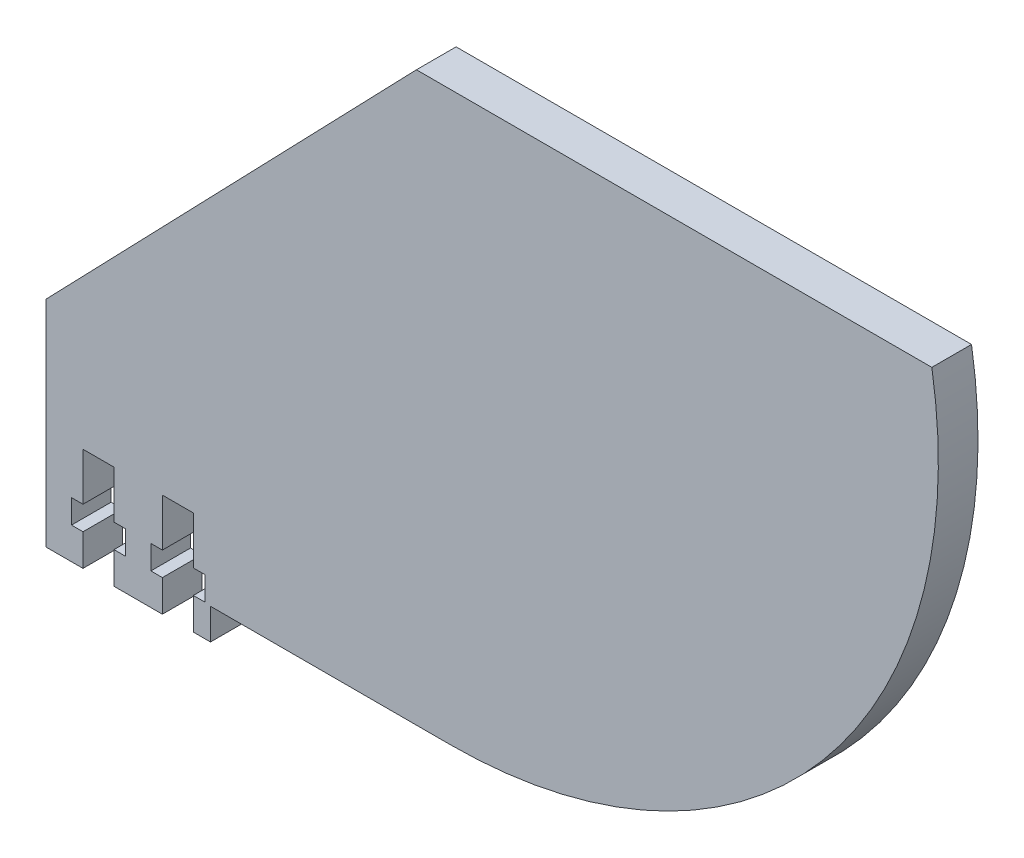
ISO-10303-21;
HEADER;
FILE_DESCRIPTION(('STEP AP214'),'2;1');
FILE_NAME('part.step','',(''),(''),'','','');
FILE_SCHEMA(('AUTOMOTIVE_DESIGN { 1 0 10303 214 1 1 1 1 }'));
ENDSEC;
DATA;
#1=APPLICATION_CONTEXT('core data for automotive mechanical design processes');
#2=APPLICATION_PROTOCOL_DEFINITION('international standard','automotive_design',2000,#1);
#3=PRODUCT_CONTEXT('',#1,'mechanical');
#4=PRODUCT('Part','Part','',(#3));
#5=PRODUCT_RELATED_PRODUCT_CATEGORY('part','',(#4));
#6=PRODUCT_DEFINITION_FORMATION('','',#4);
#7=PRODUCT_DEFINITION_CONTEXT('part definition',#1,'design');
#8=PRODUCT_DEFINITION('design','',#6,#7);
#9=PRODUCT_DEFINITION_SHAPE('','',#8);
#10=(LENGTH_UNIT() NAMED_UNIT(*) SI_UNIT(.MILLI.,.METRE.));
#11=(NAMED_UNIT(*) PLANE_ANGLE_UNIT() SI_UNIT($,.RADIAN.));
#12=(NAMED_UNIT(*) SI_UNIT($,.STERADIAN.) SOLID_ANGLE_UNIT());
#13=UNCERTAINTY_MEASURE_WITH_UNIT(LENGTH_MEASURE(1.E-05),#10,'distance_accuracy_value','');
#14=(GEOMETRIC_REPRESENTATION_CONTEXT(3) GLOBAL_UNCERTAINTY_ASSIGNED_CONTEXT((#13)) GLOBAL_UNIT_ASSIGNED_CONTEXT((#10,
#11,#12)) REPRESENTATION_CONTEXT('',''));
#15=CARTESIAN_POINT('',(0.,0.,0.));
#16=DIRECTION('',(0.,0.,1.));
#17=DIRECTION('',(1.,0.,0.));
#18=AXIS2_PLACEMENT_3D('',#15,#16,#17);
#19=CARTESIAN_POINT('',(-252.870000000149,-75.3999999999971,5.));
#20=DIRECTION('',(0.,1.,0.));
#21=DIRECTION('',(0.,0.,1.));
#22=AXIS2_PLACEMENT_3D('',#19,#20,#21);
#23=PLANE('',#22);
#24=DIRECTION('',(1.,0.,0.));
#25=VECTOR('',#24,1.);
#26=CARTESIAN_POINT('',(-252.870000000149,-75.3999999999971,0.));
#27=LINE('',#26,#25);
#28=CARTESIAN_POINT('',(-252.870000000149,-75.3999999999971,0.));
#29=VERTEX_POINT('',#28);
#30=CARTESIAN_POINT('',(-248.210000000147,-75.3999999999971,0.));
#31=VERTEX_POINT('',#30);
#32=EDGE_CURVE('E254',#29,#31,#27,.T.);
#33=ORIENTED_EDGE('',*,*,#32,.T.);
#34=DIRECTION('',(0.,0.,1.));
#35=VECTOR('',#34,1.);
#36=CARTESIAN_POINT('',(-248.210000000147,-75.3999999999971,0.));
#37=LINE('',#36,#35);
#38=CARTESIAN_POINT('',(-248.210000000147,-75.3999999999971,5.));
#39=VERTEX_POINT('',#38);
#40=EDGE_CURVE('E238',#31,#39,#37,.T.);
#41=ORIENTED_EDGE('',*,*,#40,.T.);
#42=DIRECTION('',(1.,0.,0.));
#43=VECTOR('',#42,1.);
#44=CARTESIAN_POINT('',(-252.870000000149,-75.3999999999971,5.));
#45=LINE('',#44,#43);
#46=CARTESIAN_POINT('',(-252.870000000149,-75.3999999999971,5.));
#47=VERTEX_POINT('',#46);
#48=EDGE_CURVE('E293',#47,#39,#45,.T.);
#49=ORIENTED_EDGE('',*,*,#48,.F.);
#50=DIRECTION('',(0.,0.,-1.));
#51=VECTOR('',#50,1.);
#52=CARTESIAN_POINT('',(-252.870000000149,-75.3999999999971,5.));
#53=LINE('',#52,#51);
#54=EDGE_CURVE('E11',#47,#29,#53,.T.);
#55=ORIENTED_EDGE('',*,*,#54,.T.);
#56=EDGE_LOOP('',(#33,#41,#49,#55));
#57=FACE_BOUND('',#56,.T.);
#58=ADVANCED_FACE('F35',(#57),#23,.F.);
#59=CARTESIAN_POINT('',(-244.310000000147,-75.3999999999971,5.));
#60=VERTEX_POINT('',#59);
#61=CARTESIAN_POINT('',(-238.210000000147,-75.3999999999971,5.));
#62=VERTEX_POINT('',#61);
#63=EDGE_CURVE('E295',#60,#62,#45,.T.);
#64=ORIENTED_EDGE('',*,*,#63,.F.);
#65=DIRECTION('',(0.,0.,1.));
#66=VECTOR('',#65,1.);
#67=CARTESIAN_POINT('',(-244.310000000147,-75.3999999999971,0.));
#68=LINE('',#67,#66);
#69=CARTESIAN_POINT('',(-244.310000000147,-75.3999999999971,0.));
#70=VERTEX_POINT('',#69);
#71=EDGE_CURVE('E248',#70,#60,#68,.T.);
#72=ORIENTED_EDGE('',*,*,#71,.F.);
#73=CARTESIAN_POINT('',(-238.210000000147,-75.3999999999971,0.));
#74=VERTEX_POINT('',#73);
#75=EDGE_CURVE('E263',#70,#74,#27,.T.);
#76=ORIENTED_EDGE('',*,*,#75,.T.);
#77=DIRECTION('',(0.,0.,1.));
#78=VECTOR('',#77,1.);
#79=CARTESIAN_POINT('',(-238.210000000147,-75.3999999999971,0.));
#80=LINE('',#79,#78);
#81=EDGE_CURVE('E301',#74,#62,#80,.T.);
#82=ORIENTED_EDGE('',*,*,#81,.T.);
#83=EDGE_LOOP('',(#64,#72,#76,#82));
#84=FACE_BOUND('',#83,.T.);
#85=ADVANCED_FACE('F467',(#84),#23,.F.);
#86=CARTESIAN_POINT('',(-252.870000000149,-75.3999999999971,5.));
#87=DIRECTION('',(1.,0.,0.));
#88=DIRECTION('',(0.,0.,-1.));
#89=AXIS2_PLACEMENT_3D('',#86,#87,#88);
#90=PLANE('',#89);
#91=DIRECTION('',(0.,-1.,0.));
#92=VECTOR('',#91,1.);
#93=CARTESIAN_POINT('',(-252.870000000149,-75.3999999999971,0.));
#94=LINE('',#93,#92);
#95=CARTESIAN_POINT('',(-252.870000000149,-48.3571128701587,0.));
#96=VERTEX_POINT('',#95);
#97=EDGE_CURVE('E270',#96,#29,#94,.T.);
#98=ORIENTED_EDGE('',*,*,#97,.T.);
#99=ORIENTED_EDGE('',*,*,#54,.F.);
#100=DIRECTION('',(0.,-1.,0.));
#101=VECTOR('',#100,1.);
#102=CARTESIAN_POINT('',(-252.870000000149,-75.3999999999971,5.));
#103=LINE('',#102,#101);
#104=CARTESIAN_POINT('',(-252.870000000149,-48.3571128701587,5.));
#105=VERTEX_POINT('',#104);
#106=EDGE_CURVE('E297',#105,#47,#103,.T.);
#107=ORIENTED_EDGE('',*,*,#106,.F.);
#108=DIRECTION('',(0.,0.,-1.));
#109=VECTOR('',#108,1.);
#110=CARTESIAN_POINT('',(-252.870000000149,-48.3571128701587,5.));
#111=LINE('',#110,#109);
#112=EDGE_CURVE('E284',#105,#96,#111,.T.);
#113=ORIENTED_EDGE('',*,*,#112,.T.);
#114=EDGE_LOOP('',(#98,#99,#107,#113));
#115=FACE_BOUND('',#114,.T.);
#116=ADVANCED_FACE('F37',(#115),#90,.F.);
#117=CARTESIAN_POINT('',(-234.310000000147,-75.3999999999971,5.));
#118=VERTEX_POINT('',#117);
#119=CARTESIAN_POINT('',(-232.150000000147,-75.3999999999971,5.));
#120=VERTEX_POINT('',#119);
#121=EDGE_CURVE('E296',#118,#120,#45,.T.);
#122=ORIENTED_EDGE('',*,*,#121,.F.);
#123=DIRECTION('',(0.,0.,1.));
#124=VECTOR('',#123,1.);
#125=CARTESIAN_POINT('',(-234.310000000147,-75.3999999999971,0.));
#126=LINE('',#125,#124);
#127=CARTESIAN_POINT('',(-234.310000000147,-75.3999999999971,0.));
#128=VERTEX_POINT('',#127);
#129=EDGE_CURVE('E304',#128,#118,#126,.T.);
#130=ORIENTED_EDGE('',*,*,#129,.F.);
#131=CARTESIAN_POINT('',(-232.150000000147,-75.3999999999971,0.));
#132=VERTEX_POINT('',#131);
#133=EDGE_CURVE('E265',#128,#132,#27,.T.);
#134=ORIENTED_EDGE('',*,*,#133,.T.);
#135=DIRECTION('',(0.,0.,-1.));
#136=VECTOR('',#135,1.);
#137=CARTESIAN_POINT('',(-232.150000000147,-75.3999999999971,5.));
#138=LINE('',#137,#136);
#139=EDGE_CURVE('E43',#120,#132,#138,.T.);
#140=ORIENTED_EDGE('',*,*,#139,.F.);
#141=EDGE_LOOP('',(#122,#130,#134,#140));
#142=FACE_BOUND('',#141,.T.);
#143=ADVANCED_FACE('F477',(#142),#23,.F.);
#144=CARTESIAN_POINT('',(-232.150000000147,-75.3999999999971,5.));
#145=DIRECTION('',(-1.,0.,0.));
#146=DIRECTION('',(0.,0.,1.));
#147=AXIS2_PLACEMENT_3D('',#144,#145,#146);
#148=PLANE('',#147);
#149=DIRECTION('',(0.,1.,0.));
#150=VECTOR('',#149,1.);
#151=CARTESIAN_POINT('',(-232.150000000147,-75.3999999999971,0.));
#152=LINE('',#151,#150);
#153=CARTESIAN_POINT('',(-232.150000000147,-71.4999999999999,0.));
#154=VERTEX_POINT('',#153);
#155=EDGE_CURVE('E262',#132,#154,#152,.T.);
#156=ORIENTED_EDGE('',*,*,#155,.T.);
#157=DIRECTION('',(0.,0.,-1.));
#158=VECTOR('',#157,1.);
#159=CARTESIAN_POINT('',(-232.150000000147,-71.4999999999999,5.));
#160=LINE('',#159,#158);
#161=CARTESIAN_POINT('',(-232.150000000147,-71.4999999999999,5.));
#162=VERTEX_POINT('',#161);
#163=EDGE_CURVE('E480',#162,#154,#160,.T.);
#164=ORIENTED_EDGE('',*,*,#163,.F.);
#165=DIRECTION('',(0.,1.,0.));
#166=VECTOR('',#165,1.);
#167=CARTESIAN_POINT('',(-232.150000000147,-75.3999999999971,5.));
#168=LINE('',#167,#166);
#169=EDGE_CURVE('E291',#120,#162,#168,.T.);
#170=ORIENTED_EDGE('',*,*,#169,.F.);
#171=ORIENTED_EDGE('',*,*,#139,.T.);
#172=EDGE_LOOP('',(#156,#164,#170,#171));
#173=FACE_BOUND('',#172,.T.);
#174=ADVANCED_FACE('F481',(#173),#148,.F.);
#175=CARTESIAN_POINT('',(-232.150000000147,-71.4999999999999,5.));
#176=DIRECTION('',(0.,1.,0.));
#177=DIRECTION('',(-1.,0.,0.));
#178=AXIS2_PLACEMENT_3D('',#175,#176,#177);
#179=PLANE('',#178);
#180=DIRECTION('',(1.,0.,0.));
#181=VECTOR('',#180,1.);
#182=CARTESIAN_POINT('',(-232.150000000147,-71.4999999999999,0.));
#183=LINE('',#182,#181);
#184=CARTESIAN_POINT('',(-201.961827551066,-71.4999999999999,0.));
#185=VERTEX_POINT('',#184);
#186=EDGE_CURVE('E266',#154,#185,#183,.T.);
#187=ORIENTED_EDGE('',*,*,#186,.T.);
#188=DIRECTION('',(0.,0.,-1.));
#189=VECTOR('',#188,1.);
#190=CARTESIAN_POINT('',(-201.961827551066,-71.4999999999999,5.));
#191=LINE('',#190,#189);
#192=CARTESIAN_POINT('',(-201.961827551066,-71.4999999999999,5.));
#193=VERTEX_POINT('',#192);
#194=EDGE_CURVE('E486',#193,#185,#191,.T.);
#195=ORIENTED_EDGE('',*,*,#194,.F.);
#196=DIRECTION('',(1.,0.,0.));
#197=VECTOR('',#196,1.);
#198=CARTESIAN_POINT('',(-232.150000000147,-71.4999999999999,5.));
#199=LINE('',#198,#197);
#200=EDGE_CURVE('E289',#162,#193,#199,.T.);
#201=ORIENTED_EDGE('',*,*,#200,.F.);
#202=ORIENTED_EDGE('',*,*,#163,.T.);
#203=EDGE_LOOP('',(#187,#195,#201,#202));
#204=FACE_BOUND('',#203,.T.);
#205=ADVANCED_FACE('F489',(#204),#179,.F.);
#206=CARTESIAN_POINT('',(-201.961827551066,-9.99999999999987,5.));
#207=DIRECTION('',(0.,0.,-1.));
#208=DIRECTION('',(-1.,0.,0.));
#209=AXIS2_PLACEMENT_3D('',#206,#207,#208);
#210=CYLINDRICAL_SURFACE('',#209,61.5);
#211=CARTESIAN_POINT('',(-201.961827551066,-9.99999999999987,0.));
#212=DIRECTION('',(0.,0.,1.));
#213=DIRECTION('',(1.,0.,0.));
#214=AXIS2_PLACEMENT_3D('',#211,#212,#213);
#215=CIRCLE('',#214,61.5);
#216=CARTESIAN_POINT('',(-141.280281756648,0.,0.));
#217=VERTEX_POINT('',#216);
#218=EDGE_CURVE('E500',#185,#217,#215,.T.);
#219=ORIENTED_EDGE('',*,*,#218,.T.);
#220=DIRECTION('',(0.,0.,-1.));
#221=VECTOR('',#220,1.);
#222=CARTESIAN_POINT('',(-141.280281756648,0.,5.));
#223=LINE('',#222,#221);
#224=CARTESIAN_POINT('',(-141.280281756648,0.,5.));
#225=VERTEX_POINT('',#224);
#226=EDGE_CURVE('E497',#225,#217,#223,.T.);
#227=ORIENTED_EDGE('',*,*,#226,.F.);
#228=CARTESIAN_POINT('',(-201.961827551066,-9.99999999999987,5.));
#229=DIRECTION('',(0.,0.,1.));
#230=DIRECTION('',(1.,0.,0.));
#231=AXIS2_PLACEMENT_3D('',#228,#229,#230);
#232=CIRCLE('',#231,61.5);
#233=EDGE_CURVE('E287',#193,#225,#232,.T.);
#234=ORIENTED_EDGE('',*,*,#233,.F.);
#235=ORIENTED_EDGE('',*,*,#194,.T.);
#236=EDGE_LOOP('',(#219,#227,#234,#235));
#237=FACE_BOUND('',#236,.T.);
#238=ADVANCED_FACE('F498',(#237),#210,.T.);
#239=CARTESIAN_POINT('',(-206.208901909314,8.88048315439427E-12,5.));
#240=DIRECTION('',(-1.3677301525142E-13,-1.,0.));
#241=DIRECTION('',(1.,-1.3677301525142E-13,0.));
#242=AXIS2_PLACEMENT_3D('',#239,#240,#241);
#243=PLANE('',#242);
#244=DIRECTION('',(-1.,1.3677301525142E-13,0.));
#245=VECTOR('',#244,1.);
#246=CARTESIAN_POINT('',(-206.208901909314,8.88048315439427E-12,0.));
#247=LINE('',#246,#245);
#248=CARTESIAN_POINT('',(-206.208901909314,8.88048315439427E-12,0.));
#249=VERTEX_POINT('',#248);
#250=EDGE_CURVE('E508',#217,#249,#247,.T.);
#251=ORIENTED_EDGE('',*,*,#250,.T.);
#252=DIRECTION('',(0.,0.,-1.));
#253=VECTOR('',#252,1.);
#254=CARTESIAN_POINT('',(-206.208901909314,8.88048315439427E-12,5.));
#255=LINE('',#254,#253);
#256=CARTESIAN_POINT('',(-206.208901909314,8.88048315439427E-12,5.));
#257=VERTEX_POINT('',#256);
#258=EDGE_CURVE('E503',#257,#249,#255,.T.);
#259=ORIENTED_EDGE('',*,*,#258,.F.);
#260=DIRECTION('',(-1.,1.3677301525142E-13,0.));
#261=VECTOR('',#260,1.);
#262=CARTESIAN_POINT('',(-206.208901909314,8.88048315439427E-12,5.));
#263=LINE('',#262,#261);
#264=EDGE_CURVE('E285',#225,#257,#263,.T.);
#265=ORIENTED_EDGE('',*,*,#264,.F.);
#266=ORIENTED_EDGE('',*,*,#226,.T.);
#267=EDGE_LOOP('',(#251,#259,#265,#266));
#268=FACE_BOUND('',#267,.T.);
#269=ADVANCED_FACE('F505',(#268),#243,.F.);
#270=CARTESIAN_POINT('',(-206.208901909314,8.88048315439427E-12,5.));
#271=DIRECTION('',(0.719613563334398,-0.694374768741758,0.));
#272=DIRECTION('',(0.694374768741758,0.719613563334398,0.));
#273=AXIS2_PLACEMENT_3D('',#270,#271,#272);
#274=PLANE('',#273);
#275=DIRECTION('',(-0.694374768741758,-0.719613563334398,0.));
#276=VECTOR('',#275,1.);
#277=CARTESIAN_POINT('',(-206.208901909314,8.88048315439427E-12,0.));
#278=LINE('',#277,#276);
#279=EDGE_CURVE('E300',#249,#96,#278,.T.);
#280=ORIENTED_EDGE('',*,*,#279,.T.);
#281=ORIENTED_EDGE('',*,*,#112,.F.);
#282=DIRECTION('',(-0.694374768741758,-0.719613563334398,0.));
#283=VECTOR('',#282,1.);
#284=CARTESIAN_POINT('',(-206.208901909314,8.88048315439427E-12,5.));
#285=LINE('',#284,#283);
#286=EDGE_CURVE('E282',#257,#105,#285,.T.);
#287=ORIENTED_EDGE('',*,*,#286,.F.);
#288=ORIENTED_EDGE('',*,*,#258,.T.);
#289=EDGE_LOOP('',(#280,#281,#287,#288));
#290=FACE_BOUND('',#289,.T.);
#291=ADVANCED_FACE('F513',(#290),#274,.F.);
#292=CARTESIAN_POINT('',(-201.961827551066,-9.99999999999987,5.));
#293=DIRECTION('',(0.,0.,1.));
#294=DIRECTION('',(1.,0.,0.));
#295=AXIS2_PLACEMENT_3D('',#292,#293,#294);
#296=PLANE('',#295);
#297=DIRECTION('',(0.,-1.,0.));
#298=VECTOR('',#297,1.);
#299=CARTESIAN_POINT('',(-248.210000000147,-75.3999999999971,5.));
#300=LINE('',#299,#298);
#301=CARTESIAN_POINT('',(-248.210000000147,-71.3999999999971,5.));
#302=VERTEX_POINT('',#301);
#303=EDGE_CURVE('E244',#302,#39,#300,.T.);
#304=ORIENTED_EDGE('',*,*,#303,.F.);
#305=DIRECTION('',(1.,0.,0.));
#306=VECTOR('',#305,1.);
#307=CARTESIAN_POINT('',(-248.210000000147,-71.3999999999971,5.));
#308=LINE('',#307,#306);
#309=CARTESIAN_POINT('',(-249.660000000147,-71.3999999999971,5.));
#310=VERTEX_POINT('',#309);
#311=EDGE_CURVE('E258',#310,#302,#308,.T.);
#312=ORIENTED_EDGE('',*,*,#311,.F.);
#313=DIRECTION('',(0.,-1.,0.));
#314=VECTOR('',#313,1.);
#315=CARTESIAN_POINT('',(-249.660000000147,-68.3999999999971,5.));
#316=LINE('',#315,#314);
#317=CARTESIAN_POINT('',(-249.660000000147,-68.3999999999971,5.));
#318=VERTEX_POINT('',#317);
#319=EDGE_CURVE('E409',#318,#310,#316,.T.);
#320=ORIENTED_EDGE('',*,*,#319,.F.);
#321=DIRECTION('',(-1.,0.,0.));
#322=VECTOR('',#321,1.);
#323=CARTESIAN_POINT('',(-248.210000000147,-68.3999999999971,5.));
#324=LINE('',#323,#322);
#325=CARTESIAN_POINT('',(-248.210000000147,-68.3999999999971,5.));
#326=VERTEX_POINT('',#325);
#327=EDGE_CURVE('E412',#326,#318,#324,.T.);
#328=ORIENTED_EDGE('',*,*,#327,.F.);
#329=DIRECTION('',(0.,-1.,0.));
#330=VECTOR('',#329,1.);
#331=CARTESIAN_POINT('',(-248.210000000147,-68.3999999999971,5.));
#332=LINE('',#331,#330);
#333=CARTESIAN_POINT('',(-248.210000000147,-62.3999999999971,5.));
#334=VERTEX_POINT('',#333);
#335=EDGE_CURVE('E415',#334,#326,#332,.T.);
#336=ORIENTED_EDGE('',*,*,#335,.F.);
#337=DIRECTION('',(-1.,0.,0.));
#338=VECTOR('',#337,1.);
#339=CARTESIAN_POINT('',(-248.210000000147,-62.3999999999971,5.));
#340=LINE('',#339,#338);
#341=CARTESIAN_POINT('',(-244.310000000147,-62.3999999999971,5.));
#342=VERTEX_POINT('',#341);
#343=EDGE_CURVE('E418',#342,#334,#340,.T.);
#344=ORIENTED_EDGE('',*,*,#343,.F.);
#345=DIRECTION('',(0.,1.,0.));
#346=VECTOR('',#345,1.);
#347=CARTESIAN_POINT('',(-244.310000000147,-68.3999999999971,5.));
#348=LINE('',#347,#346);
#349=CARTESIAN_POINT('',(-244.310000000147,-68.3999999999971,5.));
#350=VERTEX_POINT('',#349);
#351=EDGE_CURVE('E421',#350,#342,#348,.T.);
#352=ORIENTED_EDGE('',*,*,#351,.F.);
#353=DIRECTION('',(-1.,0.,0.));
#354=VECTOR('',#353,1.);
#355=CARTESIAN_POINT('',(-244.310000000147,-68.3999999999971,5.));
#356=LINE('',#355,#354);
#357=CARTESIAN_POINT('',(-242.860000000147,-68.3999999999971,5.));
#358=VERTEX_POINT('',#357);
#359=EDGE_CURVE('E424',#358,#350,#356,.T.);
#360=ORIENTED_EDGE('',*,*,#359,.F.);
#361=DIRECTION('',(0.,1.,0.));
#362=VECTOR('',#361,1.);
#363=CARTESIAN_POINT('',(-242.860000000147,-68.3999999999971,5.));
#364=LINE('',#363,#362);
#365=CARTESIAN_POINT('',(-242.860000000147,-71.3999999999971,5.));
#366=VERTEX_POINT('',#365);
#367=EDGE_CURVE('E427',#366,#358,#364,.T.);
#368=ORIENTED_EDGE('',*,*,#367,.F.);
#369=DIRECTION('',(1.,0.,0.));
#370=VECTOR('',#369,1.);
#371=CARTESIAN_POINT('',(-244.310000000147,-71.3999999999971,5.));
#372=LINE('',#371,#370);
#373=CARTESIAN_POINT('',(-244.310000000147,-71.3999999999971,5.));
#374=VERTEX_POINT('',#373);
#375=EDGE_CURVE('E430',#374,#366,#372,.T.);
#376=ORIENTED_EDGE('',*,*,#375,.F.);
#377=DIRECTION('',(0.,1.,0.));
#378=VECTOR('',#377,1.);
#379=CARTESIAN_POINT('',(-244.310000000147,-75.3999999999971,5.));
#380=LINE('',#379,#378);
#381=EDGE_CURVE('E433',#60,#374,#380,.T.);
#382=ORIENTED_EDGE('',*,*,#381,.F.);
#383=ORIENTED_EDGE('',*,*,#63,.T.);
#384=DIRECTION('',(0.,-1.,0.));
#385=VECTOR('',#384,1.);
#386=CARTESIAN_POINT('',(-238.210000000147,-75.3999999999971,5.));
#387=LINE('',#386,#385);
#388=CARTESIAN_POINT('',(-238.210000000147,-71.3999999999971,5.));
#389=VERTEX_POINT('',#388);
#390=EDGE_CURVE('E358',#389,#62,#387,.T.);
#391=ORIENTED_EDGE('',*,*,#390,.F.);
#392=DIRECTION('',(1.,0.,0.));
#393=VECTOR('',#392,1.);
#394=CARTESIAN_POINT('',(-238.210000000147,-71.3999999999971,5.));
#395=LINE('',#394,#393);
#396=CARTESIAN_POINT('',(-239.660000000147,-71.3999999999971,5.));
#397=VERTEX_POINT('',#396);
#398=EDGE_CURVE('E327',#397,#389,#395,.T.);
#399=ORIENTED_EDGE('',*,*,#398,.F.);
#400=DIRECTION('',(0.,-1.,0.));
#401=VECTOR('',#400,1.);
#402=CARTESIAN_POINT('',(-239.660000000147,-68.3999999999971,5.));
#403=LINE('',#402,#401);
#404=CARTESIAN_POINT('',(-239.660000000147,-68.3999999999971,5.));
#405=VERTEX_POINT('',#404);
#406=EDGE_CURVE('E331',#405,#397,#403,.T.);
#407=ORIENTED_EDGE('',*,*,#406,.F.);
#408=DIRECTION('',(-1.,0.,0.));
#409=VECTOR('',#408,1.);
#410=CARTESIAN_POINT('',(-238.210000000147,-68.3999999999971,5.));
#411=LINE('',#410,#409);
#412=CARTESIAN_POINT('',(-238.210000000147,-68.3999999999971,5.));
#413=VERTEX_POINT('',#412);
#414=EDGE_CURVE('E334',#413,#405,#411,.T.);
#415=ORIENTED_EDGE('',*,*,#414,.F.);
#416=DIRECTION('',(0.,-1.,0.));
#417=VECTOR('',#416,1.);
#418=CARTESIAN_POINT('',(-238.210000000147,-68.3999999999971,5.));
#419=LINE('',#418,#417);
#420=CARTESIAN_POINT('',(-238.210000000147,-62.3999999999971,5.));
#421=VERTEX_POINT('',#420);
#422=EDGE_CURVE('E337',#421,#413,#419,.T.);
#423=ORIENTED_EDGE('',*,*,#422,.F.);
#424=DIRECTION('',(-1.,0.,0.));
#425=VECTOR('',#424,1.);
#426=CARTESIAN_POINT('',(-238.210000000147,-62.3999999999971,5.));
#427=LINE('',#426,#425);
#428=CARTESIAN_POINT('',(-234.310000000147,-62.3999999999971,5.));
#429=VERTEX_POINT('',#428);
#430=EDGE_CURVE('E340',#429,#421,#427,.T.);
#431=ORIENTED_EDGE('',*,*,#430,.F.);
#432=DIRECTION('',(0.,1.,0.));
#433=VECTOR('',#432,1.);
#434=CARTESIAN_POINT('',(-234.310000000147,-68.3999999999971,5.));
#435=LINE('',#434,#433);
#436=CARTESIAN_POINT('',(-234.310000000147,-68.3999999999971,5.));
#437=VERTEX_POINT('',#436);
#438=EDGE_CURVE('E343',#437,#429,#435,.T.);
#439=ORIENTED_EDGE('',*,*,#438,.F.);
#440=DIRECTION('',(-1.,0.,0.));
#441=VECTOR('',#440,1.);
#442=CARTESIAN_POINT('',(-234.310000000147,-68.3999999999971,5.));
#443=LINE('',#442,#441);
#444=CARTESIAN_POINT('',(-232.860000000147,-68.3999999999971,5.));
#445=VERTEX_POINT('',#444);
#446=EDGE_CURVE('E346',#445,#437,#443,.T.);
#447=ORIENTED_EDGE('',*,*,#446,.F.);
#448=DIRECTION('',(0.,1.,0.));
#449=VECTOR('',#448,1.);
#450=CARTESIAN_POINT('',(-232.860000000147,-68.3999999999971,5.));
#451=LINE('',#450,#449);
#452=CARTESIAN_POINT('',(-232.860000000147,-71.3999999999971,5.));
#453=VERTEX_POINT('',#452);
#454=EDGE_CURVE('E349',#453,#445,#451,.T.);
#455=ORIENTED_EDGE('',*,*,#454,.F.);
#456=DIRECTION('',(1.,0.,0.));
#457=VECTOR('',#456,1.);
#458=CARTESIAN_POINT('',(-234.310000000147,-71.3999999999971,5.));
#459=LINE('',#458,#457);
#460=CARTESIAN_POINT('',(-234.310000000147,-71.3999999999971,5.));
#461=VERTEX_POINT('',#460);
#462=EDGE_CURVE('E352',#461,#453,#459,.T.);
#463=ORIENTED_EDGE('',*,*,#462,.F.);
#464=DIRECTION('',(0.,1.,0.));
#465=VECTOR('',#464,1.);
#466=CARTESIAN_POINT('',(-234.310000000147,-75.3999999999971,5.));
#467=LINE('',#466,#465);
#468=EDGE_CURVE('E355',#118,#461,#467,.T.);
#469=ORIENTED_EDGE('',*,*,#468,.F.);
#470=ORIENTED_EDGE('',*,*,#121,.T.);
#471=ORIENTED_EDGE('',*,*,#169,.T.);
#472=ORIENTED_EDGE('',*,*,#200,.T.);
#473=ORIENTED_EDGE('',*,*,#233,.T.);
#474=ORIENTED_EDGE('',*,*,#264,.T.);
#475=ORIENTED_EDGE('',*,*,#286,.T.);
#476=ORIENTED_EDGE('',*,*,#106,.T.);
#477=ORIENTED_EDGE('',*,*,#48,.T.);
#478=EDGE_LOOP('',(#304,#312,#320,#328,#336,#344,#352,#360,#368,#376,#382,#383,#391,#399,#407,
#415,#423,#431,#439,#447,#455,#463,#469,#470,#471,#472,#473,#474,#475,#476,#477));
#479=FACE_BOUND('',#478,.T.);
#480=ADVANCED_FACE('F473',(#479),#296,.T.);
#481=CARTESIAN_POINT('',(-201.961827551066,-9.99999999999987,0.));
#482=DIRECTION('',(0.,0.,1.));
#483=DIRECTION('',(1.,0.,0.));
#484=AXIS2_PLACEMENT_3D('',#481,#482,#483);
#485=PLANE('',#484);
#486=DIRECTION('',(1.,0.,0.));
#487=VECTOR('',#486,1.);
#488=CARTESIAN_POINT('',(-248.210000000147,-71.3999999999971,0.));
#489=LINE('',#488,#487);
#490=CARTESIAN_POINT('',(-249.660000000147,-71.3999999999971,0.));
#491=VERTEX_POINT('',#490);
#492=CARTESIAN_POINT('',(-248.210000000147,-71.3999999999971,0.));
#493=VERTEX_POINT('',#492);
#494=EDGE_CURVE('E249',#491,#493,#489,.T.);
#495=ORIENTED_EDGE('',*,*,#494,.T.);
#496=DIRECTION('',(0.,-1.,0.));
#497=VECTOR('',#496,1.);
#498=CARTESIAN_POINT('',(-248.210000000147,-75.3999999999971,0.));
#499=LINE('',#498,#497);
#500=EDGE_CURVE('E241',#493,#31,#499,.T.);
#501=ORIENTED_EDGE('',*,*,#500,.T.);
#502=ORIENTED_EDGE('',*,*,#32,.F.);
#503=ORIENTED_EDGE('',*,*,#97,.F.);
#504=ORIENTED_EDGE('',*,*,#279,.F.);
#505=ORIENTED_EDGE('',*,*,#250,.F.);
#506=ORIENTED_EDGE('',*,*,#218,.F.);
#507=ORIENTED_EDGE('',*,*,#186,.F.);
#508=ORIENTED_EDGE('',*,*,#155,.F.);
#509=ORIENTED_EDGE('',*,*,#133,.F.);
#510=DIRECTION('',(0.,1.,0.));
#511=VECTOR('',#510,1.);
#512=CARTESIAN_POINT('',(-234.310000000147,-75.3999999999971,0.));
#513=LINE('',#512,#511);
#514=CARTESIAN_POINT('',(-234.310000000147,-71.3999999999971,0.));
#515=VERTEX_POINT('',#514);
#516=EDGE_CURVE('E384',#128,#515,#513,.T.);
#517=ORIENTED_EDGE('',*,*,#516,.T.);
#518=DIRECTION('',(1.,0.,0.));
#519=VECTOR('',#518,1.);
#520=CARTESIAN_POINT('',(-234.310000000147,-71.3999999999971,0.));
#521=LINE('',#520,#519);
#522=CARTESIAN_POINT('',(-232.860000000147,-71.3999999999971,0.));
#523=VERTEX_POINT('',#522);
#524=EDGE_CURVE('E58',#515,#523,#521,.T.);
#525=ORIENTED_EDGE('',*,*,#524,.T.);
#526=DIRECTION('',(0.,1.,0.));
#527=VECTOR('',#526,1.);
#528=CARTESIAN_POINT('',(-232.860000000147,-68.3999999999971,0.));
#529=LINE('',#528,#527);
#530=CARTESIAN_POINT('',(-232.860000000147,-68.3999999999971,0.));
#531=VERTEX_POINT('',#530);
#532=EDGE_CURVE('E380',#523,#531,#529,.T.);
#533=ORIENTED_EDGE('',*,*,#532,.T.);
#534=DIRECTION('',(-1.,0.,0.));
#535=VECTOR('',#534,1.);
#536=CARTESIAN_POINT('',(-234.310000000147,-68.3999999999971,0.));
#537=LINE('',#536,#535);
#538=CARTESIAN_POINT('',(-234.310000000147,-68.3999999999971,0.));
#539=VERTEX_POINT('',#538);
#540=EDGE_CURVE('E377',#531,#539,#537,.T.);
#541=ORIENTED_EDGE('',*,*,#540,.T.);
#542=DIRECTION('',(0.,1.,0.));
#543=VECTOR('',#542,1.);
#544=CARTESIAN_POINT('',(-234.310000000147,-68.3999999999971,0.));
#545=LINE('',#544,#543);
#546=CARTESIAN_POINT('',(-234.310000000147,-62.3999999999971,0.));
#547=VERTEX_POINT('',#546);
#548=EDGE_CURVE('E374',#539,#547,#545,.T.);
#549=ORIENTED_EDGE('',*,*,#548,.T.);
#550=DIRECTION('',(-1.,0.,0.));
#551=VECTOR('',#550,1.);
#552=CARTESIAN_POINT('',(-238.210000000147,-62.3999999999971,0.));
#553=LINE('',#552,#551);
#554=CARTESIAN_POINT('',(-238.210000000147,-62.3999999999971,0.));
#555=VERTEX_POINT('',#554);
#556=EDGE_CURVE('E371',#547,#555,#553,.T.);
#557=ORIENTED_EDGE('',*,*,#556,.T.);
#558=DIRECTION('',(0.,-1.,0.));
#559=VECTOR('',#558,1.);
#560=CARTESIAN_POINT('',(-238.210000000147,-68.3999999999971,0.));
#561=LINE('',#560,#559);
#562=CARTESIAN_POINT('',(-238.210000000147,-68.3999999999971,0.));
#563=VERTEX_POINT('',#562);
#564=EDGE_CURVE('E368',#555,#563,#561,.T.);
#565=ORIENTED_EDGE('',*,*,#564,.T.);
#566=DIRECTION('',(-1.,0.,0.));
#567=VECTOR('',#566,1.);
#568=CARTESIAN_POINT('',(-238.210000000147,-68.3999999999971,0.));
#569=LINE('',#568,#567);
#570=CARTESIAN_POINT('',(-239.660000000147,-68.3999999999971,0.));
#571=VERTEX_POINT('',#570);
#572=EDGE_CURVE('E365',#563,#571,#569,.T.);
#573=ORIENTED_EDGE('',*,*,#572,.T.);
#574=DIRECTION('',(0.,-1.,0.));
#575=VECTOR('',#574,1.);
#576=CARTESIAN_POINT('',(-239.660000000147,-68.3999999999971,0.));
#577=LINE('',#576,#575);
#578=CARTESIAN_POINT('',(-239.660000000147,-71.3999999999971,0.));
#579=VERTEX_POINT('',#578);
#580=EDGE_CURVE('E362',#571,#579,#577,.T.);
#581=ORIENTED_EDGE('',*,*,#580,.T.);
#582=DIRECTION('',(1.,0.,0.));
#583=VECTOR('',#582,1.);
#584=CARTESIAN_POINT('',(-238.210000000147,-71.3999999999971,0.));
#585=LINE('',#584,#583);
#586=CARTESIAN_POINT('',(-238.210000000147,-71.3999999999971,0.));
#587=VERTEX_POINT('',#586);
#588=EDGE_CURVE('E305',#579,#587,#585,.T.);
#589=ORIENTED_EDGE('',*,*,#588,.T.);
#590=DIRECTION('',(0.,-1.,0.));
#591=VECTOR('',#590,1.);
#592=CARTESIAN_POINT('',(-238.210000000147,-75.3999999999971,0.));
#593=LINE('',#592,#591);
#594=EDGE_CURVE('E330',#587,#74,#593,.T.);
#595=ORIENTED_EDGE('',*,*,#594,.T.);
#596=ORIENTED_EDGE('',*,*,#75,.F.);
#597=DIRECTION('',(0.,1.,0.));
#598=VECTOR('',#597,1.);
#599=CARTESIAN_POINT('',(-244.310000000147,-75.3999999999971,0.));
#600=LINE('',#599,#598);
#601=CARTESIAN_POINT('',(-244.310000000147,-71.3999999999971,0.));
#602=VERTEX_POINT('',#601);
#603=EDGE_CURVE('E257',#70,#602,#600,.T.);
#604=ORIENTED_EDGE('',*,*,#603,.T.);
#605=DIRECTION('',(1.,0.,0.));
#606=VECTOR('',#605,1.);
#607=CARTESIAN_POINT('',(-244.310000000147,-71.3999999999971,0.));
#608=LINE('',#607,#606);
#609=CARTESIAN_POINT('',(-242.860000000147,-71.3999999999971,0.));
#610=VERTEX_POINT('',#609);
#611=EDGE_CURVE('E50',#602,#610,#608,.T.);
#612=ORIENTED_EDGE('',*,*,#611,.T.);
#613=DIRECTION('',(0.,1.,0.));
#614=VECTOR('',#613,1.);
#615=CARTESIAN_POINT('',(-242.860000000147,-68.3999999999971,0.));
#616=LINE('',#615,#614);
#617=CARTESIAN_POINT('',(-242.860000000147,-68.3999999999971,0.));
#618=VERTEX_POINT('',#617);
#619=EDGE_CURVE('E455',#610,#618,#616,.T.);
#620=ORIENTED_EDGE('',*,*,#619,.T.);
#621=DIRECTION('',(-1.,0.,0.));
#622=VECTOR('',#621,1.);
#623=CARTESIAN_POINT('',(-244.310000000147,-68.3999999999971,0.));
#624=LINE('',#623,#622);
#625=CARTESIAN_POINT('',(-244.310000000147,-68.3999999999971,0.));
#626=VERTEX_POINT('',#625);
#627=EDGE_CURVE('E452',#618,#626,#624,.T.);
#628=ORIENTED_EDGE('',*,*,#627,.T.);
#629=DIRECTION('',(0.,1.,0.));
#630=VECTOR('',#629,1.);
#631=CARTESIAN_POINT('',(-244.310000000147,-68.3999999999971,0.));
#632=LINE('',#631,#630);
#633=CARTESIAN_POINT('',(-244.310000000147,-62.3999999999971,0.));
#634=VERTEX_POINT('',#633);
#635=EDGE_CURVE('E449',#626,#634,#632,.T.);
#636=ORIENTED_EDGE('',*,*,#635,.T.);
#637=DIRECTION('',(-1.,0.,0.));
#638=VECTOR('',#637,1.);
#639=CARTESIAN_POINT('',(-248.210000000147,-62.3999999999971,0.));
#640=LINE('',#639,#638);
#641=CARTESIAN_POINT('',(-248.210000000147,-62.3999999999971,0.));
#642=VERTEX_POINT('',#641);
#643=EDGE_CURVE('E446',#634,#642,#640,.T.);
#644=ORIENTED_EDGE('',*,*,#643,.T.);
#645=DIRECTION('',(0.,-1.,0.));
#646=VECTOR('',#645,1.);
#647=CARTESIAN_POINT('',(-248.210000000147,-68.3999999999971,0.));
#648=LINE('',#647,#646);
#649=CARTESIAN_POINT('',(-248.210000000147,-68.3999999999971,0.));
#650=VERTEX_POINT('',#649);
#651=EDGE_CURVE('E443',#642,#650,#648,.T.);
#652=ORIENTED_EDGE('',*,*,#651,.T.);
#653=DIRECTION('',(-1.,0.,0.));
#654=VECTOR('',#653,1.);
#655=CARTESIAN_POINT('',(-248.210000000147,-68.3999999999971,0.));
#656=LINE('',#655,#654);
#657=CARTESIAN_POINT('',(-249.660000000147,-68.3999999999971,0.));
#658=VERTEX_POINT('',#657);
#659=EDGE_CURVE('E440',#650,#658,#656,.T.);
#660=ORIENTED_EDGE('',*,*,#659,.T.);
#661=DIRECTION('',(0.,-1.,0.));
#662=VECTOR('',#661,1.);
#663=CARTESIAN_POINT('',(-249.660000000147,-68.3999999999971,0.));
#664=LINE('',#663,#662);
#665=EDGE_CURVE('E438',#658,#491,#664,.T.);
#666=ORIENTED_EDGE('',*,*,#665,.T.);
#667=EDGE_LOOP('',(#495,#501,#502,#503,#504,#505,#506,#507,#508,#509,#517,#525,#533,#541,#549,
#557,#565,#573,#581,#589,#595,#596,#604,#612,#620,#628,#636,#644,#652,#660,#666));
#668=FACE_BOUND('',#667,.T.);
#669=ADVANCED_FACE('F252',(#668),#485,.F.);
#670=CARTESIAN_POINT('',(-238.210000000147,-75.3999999999971,0.));
#671=DIRECTION('',(-1.,0.,0.));
#672=DIRECTION('',(0.,0.,1.));
#673=AXIS2_PLACEMENT_3D('',#670,#671,#672);
#674=PLANE('',#673);
#675=ORIENTED_EDGE('',*,*,#390,.T.);
#676=ORIENTED_EDGE('',*,*,#81,.F.);
#677=ORIENTED_EDGE('',*,*,#594,.F.);
#678=DIRECTION('',(0.,0.,1.));
#679=VECTOR('',#678,1.);
#680=CARTESIAN_POINT('',(-238.210000000147,-71.3999999999971,0.));
#681=LINE('',#680,#679);
#682=EDGE_CURVE('E325',#587,#389,#681,.T.);
#683=ORIENTED_EDGE('',*,*,#682,.T.);
#684=EDGE_LOOP('',(#675,#676,#677,#683));
#685=FACE_BOUND('',#684,.T.);
#686=ADVANCED_FACE('F536',(#685),#674,.F.);
#687=CARTESIAN_POINT('',(-238.210000000147,-71.3999999999971,0.));
#688=DIRECTION('',(0.,-1.,0.));
#689=DIRECTION('',(0.,0.,-1.));
#690=AXIS2_PLACEMENT_3D('',#687,#688,#689);
#691=PLANE('',#690);
#692=ORIENTED_EDGE('',*,*,#398,.T.);
#693=ORIENTED_EDGE('',*,*,#682,.F.);
#694=ORIENTED_EDGE('',*,*,#588,.F.);
#695=DIRECTION('',(0.,0.,1.));
#696=VECTOR('',#695,1.);
#697=CARTESIAN_POINT('',(-239.660000000147,-71.3999999999971,0.));
#698=LINE('',#697,#696);
#699=EDGE_CURVE('E323',#579,#397,#698,.T.);
#700=ORIENTED_EDGE('',*,*,#699,.T.);
#701=EDGE_LOOP('',(#692,#693,#694,#700));
#702=FACE_BOUND('',#701,.T.);
#703=ADVANCED_FACE('F541',(#702),#691,.F.);
#704=CARTESIAN_POINT('',(-239.660000000147,-68.3999999999971,0.));
#705=DIRECTION('',(-1.,0.,0.));
#706=DIRECTION('',(0.,0.,1.));
#707=AXIS2_PLACEMENT_3D('',#704,#705,#706);
#708=PLANE('',#707);
#709=ORIENTED_EDGE('',*,*,#406,.T.);
#710=ORIENTED_EDGE('',*,*,#699,.F.);
#711=ORIENTED_EDGE('',*,*,#580,.F.);
#712=DIRECTION('',(0.,0.,1.));
#713=VECTOR('',#712,1.);
#714=CARTESIAN_POINT('',(-239.660000000147,-68.3999999999971,0.));
#715=LINE('',#714,#713);
#716=EDGE_CURVE('E321',#571,#405,#715,.T.);
#717=ORIENTED_EDGE('',*,*,#716,.T.);
#718=EDGE_LOOP('',(#709,#710,#711,#717));
#719=FACE_BOUND('',#718,.T.);
#720=ADVANCED_FACE('F573',(#719),#708,.F.);
#721=CARTESIAN_POINT('',(-238.210000000147,-68.3999999999971,0.));
#722=DIRECTION('',(0.,1.,0.));
#723=DIRECTION('',(0.,0.,1.));
#724=AXIS2_PLACEMENT_3D('',#721,#722,#723);
#725=PLANE('',#724);
#726=ORIENTED_EDGE('',*,*,#414,.T.);
#727=ORIENTED_EDGE('',*,*,#716,.F.);
#728=ORIENTED_EDGE('',*,*,#572,.F.);
#729=DIRECTION('',(0.,0.,1.));
#730=VECTOR('',#729,1.);
#731=CARTESIAN_POINT('',(-238.210000000147,-68.3999999999971,0.));
#732=LINE('',#731,#730);
#733=EDGE_CURVE('E319',#563,#413,#732,.T.);
#734=ORIENTED_EDGE('',*,*,#733,.T.);
#735=EDGE_LOOP('',(#726,#727,#728,#734));
#736=FACE_BOUND('',#735,.T.);
#737=ADVANCED_FACE('F569',(#736),#725,.F.);
#738=CARTESIAN_POINT('',(-238.210000000147,-68.3999999999971,0.));
#739=DIRECTION('',(-1.,0.,0.));
#740=DIRECTION('',(0.,0.,1.));
#741=AXIS2_PLACEMENT_3D('',#738,#739,#740);
#742=PLANE('',#741);
#743=ORIENTED_EDGE('',*,*,#422,.T.);
#744=ORIENTED_EDGE('',*,*,#733,.F.);
#745=ORIENTED_EDGE('',*,*,#564,.F.);
#746=DIRECTION('',(0.,0.,1.));
#747=VECTOR('',#746,1.);
#748=CARTESIAN_POINT('',(-238.210000000147,-62.3999999999971,0.));
#749=LINE('',#748,#747);
#750=EDGE_CURVE('E317',#555,#421,#749,.T.);
#751=ORIENTED_EDGE('',*,*,#750,.T.);
#752=EDGE_LOOP('',(#743,#744,#745,#751));
#753=FACE_BOUND('',#752,.T.);
#754=ADVANCED_FACE('F565',(#753),#742,.F.);
#755=CARTESIAN_POINT('',(-238.210000000147,-62.3999999999971,0.));
#756=DIRECTION('',(0.,1.,0.));
#757=DIRECTION('',(-1.,0.,0.));
#758=AXIS2_PLACEMENT_3D('',#755,#756,#757);
#759=PLANE('',#758);
#760=ORIENTED_EDGE('',*,*,#430,.T.);
#761=ORIENTED_EDGE('',*,*,#750,.F.);
#762=ORIENTED_EDGE('',*,*,#556,.F.);
#763=DIRECTION('',(0.,0.,1.));
#764=VECTOR('',#763,1.);
#765=CARTESIAN_POINT('',(-234.310000000147,-62.3999999999971,0.));
#766=LINE('',#765,#764);
#767=EDGE_CURVE('E315',#547,#429,#766,.T.);
#768=ORIENTED_EDGE('',*,*,#767,.T.);
#769=EDGE_LOOP('',(#760,#761,#762,#768));
#770=FACE_BOUND('',#769,.T.);
#771=ADVANCED_FACE('F561',(#770),#759,.F.);
#772=CARTESIAN_POINT('',(-234.310000000147,-68.3999999999971,0.));
#773=DIRECTION('',(1.,0.,0.));
#774=DIRECTION('',(0.,0.,-1.));
#775=AXIS2_PLACEMENT_3D('',#772,#773,#774);
#776=PLANE('',#775);
#777=ORIENTED_EDGE('',*,*,#438,.T.);
#778=ORIENTED_EDGE('',*,*,#767,.F.);
#779=ORIENTED_EDGE('',*,*,#548,.F.);
#780=DIRECTION('',(0.,0.,1.));
#781=VECTOR('',#780,1.);
#782=CARTESIAN_POINT('',(-234.310000000147,-68.3999999999971,0.));
#783=LINE('',#782,#781);
#784=EDGE_CURVE('E313',#539,#437,#783,.T.);
#785=ORIENTED_EDGE('',*,*,#784,.T.);
#786=EDGE_LOOP('',(#777,#778,#779,#785));
#787=FACE_BOUND('',#786,.T.);
#788=ADVANCED_FACE('F557',(#787),#776,.F.);
#789=CARTESIAN_POINT('',(-234.310000000147,-68.3999999999971,0.));
#790=DIRECTION('',(0.,1.,0.));
#791=DIRECTION('',(-1.,0.,0.));
#792=AXIS2_PLACEMENT_3D('',#789,#790,#791);
#793=PLANE('',#792);
#794=ORIENTED_EDGE('',*,*,#446,.T.);
#795=ORIENTED_EDGE('',*,*,#784,.F.);
#796=ORIENTED_EDGE('',*,*,#540,.F.);
#797=DIRECTION('',(0.,0.,1.));
#798=VECTOR('',#797,1.);
#799=CARTESIAN_POINT('',(-232.860000000147,-68.3999999999971,0.));
#800=LINE('',#799,#798);
#801=EDGE_CURVE('E311',#531,#445,#800,.T.);
#802=ORIENTED_EDGE('',*,*,#801,.T.);
#803=EDGE_LOOP('',(#794,#795,#796,#802));
#804=FACE_BOUND('',#803,.T.);
#805=ADVANCED_FACE('F553',(#804),#793,.F.);
#806=CARTESIAN_POINT('',(-232.860000000147,-68.3999999999971,0.));
#807=DIRECTION('',(1.,0.,0.));
#808=DIRECTION('',(0.,1.,0.));
#809=AXIS2_PLACEMENT_3D('',#806,#807,#808);
#810=PLANE('',#809);
#811=ORIENTED_EDGE('',*,*,#454,.T.);
#812=ORIENTED_EDGE('',*,*,#801,.F.);
#813=ORIENTED_EDGE('',*,*,#532,.F.);
#814=DIRECTION('',(0.,0.,1.));
#815=VECTOR('',#814,1.);
#816=CARTESIAN_POINT('',(-232.860000000147,-71.3999999999971,0.));
#817=LINE('',#816,#815);
#818=EDGE_CURVE('E309',#523,#453,#817,.T.);
#819=ORIENTED_EDGE('',*,*,#818,.T.);
#820=EDGE_LOOP('',(#811,#812,#813,#819));
#821=FACE_BOUND('',#820,.T.);
#822=ADVANCED_FACE('F550',(#821),#810,.F.);
#823=CARTESIAN_POINT('',(-234.310000000147,-71.3999999999971,0.));
#824=DIRECTION('',(0.,-1.,0.));
#825=DIRECTION('',(1.,0.,0.));
#826=AXIS2_PLACEMENT_3D('',#823,#824,#825);
#827=PLANE('',#826);
#828=ORIENTED_EDGE('',*,*,#462,.T.);
#829=ORIENTED_EDGE('',*,*,#818,.F.);
#830=ORIENTED_EDGE('',*,*,#524,.F.);
#831=DIRECTION('',(0.,0.,1.));
#832=VECTOR('',#831,1.);
#833=CARTESIAN_POINT('',(-234.310000000147,-71.3999999999971,0.));
#834=LINE('',#833,#832);
#835=EDGE_CURVE('E307',#515,#461,#834,.T.);
#836=ORIENTED_EDGE('',*,*,#835,.T.);
#837=EDGE_LOOP('',(#828,#829,#830,#836));
#838=FACE_BOUND('',#837,.T.);
#839=ADVANCED_FACE('F546',(#838),#827,.F.);
#840=CARTESIAN_POINT('',(-234.310000000147,-75.3999999999971,0.));
#841=DIRECTION('',(1.,0.,0.));
#842=DIRECTION('',(0.,0.,-1.));
#843=AXIS2_PLACEMENT_3D('',#840,#841,#842);
#844=PLANE('',#843);
#845=ORIENTED_EDGE('',*,*,#468,.T.);
#846=ORIENTED_EDGE('',*,*,#835,.F.);
#847=ORIENTED_EDGE('',*,*,#516,.F.);
#848=ORIENTED_EDGE('',*,*,#129,.T.);
#849=EDGE_LOOP('',(#845,#846,#847,#848));
#850=FACE_BOUND('',#849,.T.);
#851=ADVANCED_FACE('F543',(#850),#844,.F.);
#852=CARTESIAN_POINT('',(-248.210000000147,-75.3999999999971,0.));
#853=DIRECTION('',(-1.,0.,0.));
#854=DIRECTION('',(0.,-1.,0.));
#855=AXIS2_PLACEMENT_3D('',#852,#853,#854);
#856=PLANE('',#855);
#857=ORIENTED_EDGE('',*,*,#303,.T.);
#858=ORIENTED_EDGE('',*,*,#40,.F.);
#859=ORIENTED_EDGE('',*,*,#500,.F.);
#860=DIRECTION('',(0.,0.,1.));
#861=VECTOR('',#860,1.);
#862=CARTESIAN_POINT('',(-248.210000000147,-71.3999999999971,0.));
#863=LINE('',#862,#861);
#864=EDGE_CURVE('E276',#493,#302,#863,.T.);
#865=ORIENTED_EDGE('',*,*,#864,.T.);
#866=EDGE_LOOP('',(#857,#858,#859,#865));
#867=FACE_BOUND('',#866,.T.);
#868=ADVANCED_FACE('F240',(#867),#856,.F.);
#869=CARTESIAN_POINT('',(-248.210000000147,-71.3999999999971,0.));
#870=DIRECTION('',(0.,-1.,0.));
#871=DIRECTION('',(0.,0.,-1.));
#872=AXIS2_PLACEMENT_3D('',#869,#870,#871);
#873=PLANE('',#872);
#874=ORIENTED_EDGE('',*,*,#311,.T.);
#875=ORIENTED_EDGE('',*,*,#864,.F.);
#876=ORIENTED_EDGE('',*,*,#494,.F.);
#877=DIRECTION('',(0.,0.,1.));
#878=VECTOR('',#877,1.);
#879=CARTESIAN_POINT('',(-249.660000000147,-71.3999999999971,0.));
#880=LINE('',#879,#878);
#881=EDGE_CURVE('E279',#491,#310,#880,.T.);
#882=ORIENTED_EDGE('',*,*,#881,.T.);
#883=EDGE_LOOP('',(#874,#875,#876,#882));
#884=FACE_BOUND('',#883,.T.);
#885=ADVANCED_FACE('F583',(#884),#873,.F.);
#886=CARTESIAN_POINT('',(-249.660000000147,-68.3999999999971,0.));
#887=DIRECTION('',(-1.,0.,0.));
#888=DIRECTION('',(0.,0.,1.));
#889=AXIS2_PLACEMENT_3D('',#886,#887,#888);
#890=PLANE('',#889);
#891=ORIENTED_EDGE('',*,*,#319,.T.);
#892=ORIENTED_EDGE('',*,*,#881,.F.);
#893=ORIENTED_EDGE('',*,*,#665,.F.);
#894=DIRECTION('',(0.,0.,1.));
#895=VECTOR('',#894,1.);
#896=CARTESIAN_POINT('',(-249.660000000147,-68.3999999999971,0.));
#897=LINE('',#896,#895);
#898=EDGE_CURVE('E404',#658,#318,#897,.T.);
#899=ORIENTED_EDGE('',*,*,#898,.T.);
#900=EDGE_LOOP('',(#891,#892,#893,#899));
#901=FACE_BOUND('',#900,.T.);
#902=ADVANCED_FACE('F612',(#901),#890,.F.);
#903=CARTESIAN_POINT('',(-248.210000000147,-68.3999999999971,0.));
#904=DIRECTION('',(0.,1.,0.));
#905=DIRECTION('',(0.,0.,1.));
#906=AXIS2_PLACEMENT_3D('',#903,#904,#905);
#907=PLANE('',#906);
#908=ORIENTED_EDGE('',*,*,#327,.T.);
#909=ORIENTED_EDGE('',*,*,#898,.F.);
#910=ORIENTED_EDGE('',*,*,#659,.F.);
#911=DIRECTION('',(0.,0.,1.));
#912=VECTOR('',#911,1.);
#913=CARTESIAN_POINT('',(-248.210000000147,-68.3999999999971,0.));
#914=LINE('',#913,#912);
#915=EDGE_CURVE('E402',#650,#326,#914,.T.);
#916=ORIENTED_EDGE('',*,*,#915,.T.);
#917=EDGE_LOOP('',(#908,#909,#910,#916));
#918=FACE_BOUND('',#917,.T.);
#919=ADVANCED_FACE('F608',(#918),#907,.F.);
#920=CARTESIAN_POINT('',(-248.210000000147,-68.3999999999971,0.));
#921=DIRECTION('',(-1.,0.,0.));
#922=DIRECTION('',(0.,-1.,0.));
#923=AXIS2_PLACEMENT_3D('',#920,#921,#922);
#924=PLANE('',#923);
#925=ORIENTED_EDGE('',*,*,#335,.T.);
#926=ORIENTED_EDGE('',*,*,#915,.F.);
#927=ORIENTED_EDGE('',*,*,#651,.F.);
#928=DIRECTION('',(0.,0.,1.));
#929=VECTOR('',#928,1.);
#930=CARTESIAN_POINT('',(-248.210000000147,-62.3999999999971,0.));
#931=LINE('',#930,#929);
#932=EDGE_CURVE('E400',#642,#334,#931,.T.);
#933=ORIENTED_EDGE('',*,*,#932,.T.);
#934=EDGE_LOOP('',(#925,#926,#927,#933));
#935=FACE_BOUND('',#934,.T.);
#936=ADVANCED_FACE('F604',(#935),#924,.F.);
#937=CARTESIAN_POINT('',(-248.210000000147,-62.3999999999971,0.));
#938=DIRECTION('',(0.,1.,0.));
#939=DIRECTION('',(0.,0.,1.));
#940=AXIS2_PLACEMENT_3D('',#937,#938,#939);
#941=PLANE('',#940);
#942=ORIENTED_EDGE('',*,*,#343,.T.);
#943=ORIENTED_EDGE('',*,*,#932,.F.);
#944=ORIENTED_EDGE('',*,*,#643,.F.);
#945=DIRECTION('',(0.,0.,1.));
#946=VECTOR('',#945,1.);
#947=CARTESIAN_POINT('',(-244.310000000147,-62.3999999999971,0.));
#948=LINE('',#947,#946);
#949=EDGE_CURVE('E398',#634,#342,#948,.T.);
#950=ORIENTED_EDGE('',*,*,#949,.T.);
#951=EDGE_LOOP('',(#942,#943,#944,#950));
#952=FACE_BOUND('',#951,.T.);
#953=ADVANCED_FACE('F600',(#952),#941,.F.);
#954=CARTESIAN_POINT('',(-244.310000000147,-68.3999999999971,0.));
#955=DIRECTION('',(1.,0.,0.));
#956=DIRECTION('',(0.,0.,-1.));
#957=AXIS2_PLACEMENT_3D('',#954,#955,#956);
#958=PLANE('',#957);
#959=ORIENTED_EDGE('',*,*,#351,.T.);
#960=ORIENTED_EDGE('',*,*,#949,.F.);
#961=ORIENTED_EDGE('',*,*,#635,.F.);
#962=DIRECTION('',(0.,0.,1.));
#963=VECTOR('',#962,1.);
#964=CARTESIAN_POINT('',(-244.310000000147,-68.3999999999971,0.));
#965=LINE('',#964,#963);
#966=EDGE_CURVE('E396',#626,#350,#965,.T.);
#967=ORIENTED_EDGE('',*,*,#966,.T.);
#968=EDGE_LOOP('',(#959,#960,#961,#967));
#969=FACE_BOUND('',#968,.T.);
#970=ADVANCED_FACE('F596',(#969),#958,.F.);
#971=CARTESIAN_POINT('',(-244.310000000147,-68.3999999999971,0.));
#972=DIRECTION('',(0.,1.,0.));
#973=DIRECTION('',(0.,0.,1.));
#974=AXIS2_PLACEMENT_3D('',#971,#972,#973);
#975=PLANE('',#974);
#976=ORIENTED_EDGE('',*,*,#359,.T.);
#977=ORIENTED_EDGE('',*,*,#966,.F.);
#978=ORIENTED_EDGE('',*,*,#627,.F.);
#979=DIRECTION('',(0.,0.,1.));
#980=VECTOR('',#979,1.);
#981=CARTESIAN_POINT('',(-242.860000000147,-68.3999999999971,0.));
#982=LINE('',#981,#980);
#983=EDGE_CURVE('E394',#618,#358,#982,.T.);
#984=ORIENTED_EDGE('',*,*,#983,.T.);
#985=EDGE_LOOP('',(#976,#977,#978,#984));
#986=FACE_BOUND('',#985,.T.);
#987=ADVANCED_FACE('F592',(#986),#975,.F.);
#988=CARTESIAN_POINT('',(-242.860000000147,-68.3999999999971,0.));
#989=DIRECTION('',(1.,0.,0.));
#990=DIRECTION('',(0.,0.,-1.));
#991=AXIS2_PLACEMENT_3D('',#988,#989,#990);
#992=PLANE('',#991);
#993=ORIENTED_EDGE('',*,*,#367,.T.);
#994=ORIENTED_EDGE('',*,*,#983,.F.);
#995=ORIENTED_EDGE('',*,*,#619,.F.);
#996=DIRECTION('',(0.,0.,1.));
#997=VECTOR('',#996,1.);
#998=CARTESIAN_POINT('',(-242.860000000147,-71.3999999999971,0.));
#999=LINE('',#998,#997);
#1000=EDGE_CURVE('E392',#610,#366,#999,.T.);
#1001=ORIENTED_EDGE('',*,*,#1000,.T.);
#1002=EDGE_LOOP('',(#993,#994,#995,#1001));
#1003=FACE_BOUND('',#1002,.T.);
#1004=ADVANCED_FACE('F589',(#1003),#992,.F.);
#1005=CARTESIAN_POINT('',(-244.310000000147,-71.3999999999971,0.));
#1006=DIRECTION('',(0.,-1.,0.));
#1007=DIRECTION('',(0.,0.,-1.));
#1008=AXIS2_PLACEMENT_3D('',#1005,#1006,#1007);
#1009=PLANE('',#1008);
#1010=ORIENTED_EDGE('',*,*,#375,.T.);
#1011=ORIENTED_EDGE('',*,*,#1000,.F.);
#1012=ORIENTED_EDGE('',*,*,#611,.F.);
#1013=DIRECTION('',(0.,0.,1.));
#1014=VECTOR('',#1013,1.);
#1015=CARTESIAN_POINT('',(-244.310000000147,-71.3999999999971,0.));
#1016=LINE('',#1015,#1014);
#1017=EDGE_CURVE('E390',#602,#374,#1016,.T.);
#1018=ORIENTED_EDGE('',*,*,#1017,.T.);
#1019=EDGE_LOOP('',(#1010,#1011,#1012,#1018));
#1020=FACE_BOUND('',#1019,.T.);
#1021=ADVANCED_FACE('F586',(#1020),#1009,.F.);
#1022=CARTESIAN_POINT('',(-244.310000000147,-75.3999999999971,0.));
#1023=DIRECTION('',(1.,0.,0.));
#1024=DIRECTION('',(0.,1.,0.));
#1025=AXIS2_PLACEMENT_3D('',#1022,#1023,#1024);
#1026=PLANE('',#1025);
#1027=ORIENTED_EDGE('',*,*,#381,.T.);
#1028=ORIENTED_EDGE('',*,*,#1017,.F.);
#1029=ORIENTED_EDGE('',*,*,#603,.F.);
#1030=ORIENTED_EDGE('',*,*,#71,.T.);
#1031=EDGE_LOOP('',(#1027,#1028,#1029,#1030));
#1032=FACE_BOUND('',#1031,.T.);
#1033=ADVANCED_FACE('F463',(#1032),#1026,.F.);
#1034=CLOSED_SHELL('',(#58,#85,#116,#143,#174,#205,#238,#269,#291,#480,#669,#686,#703,#720,#737,
#754,#771,#788,#805,#822,#839,#851,#868,#885,#902,#919,#936,#953,#970,#987,#1004,#1021,#1033));
#1035=MANIFOLD_SOLID_BREP('B2',#1034);
#1036=ADVANCED_BREP_SHAPE_REPRESENTATION('',(#18,#1035),#14);
#1037=SHAPE_DEFINITION_REPRESENTATION(#9,#1036);
ENDSEC;
END-ISO-10303-21;
